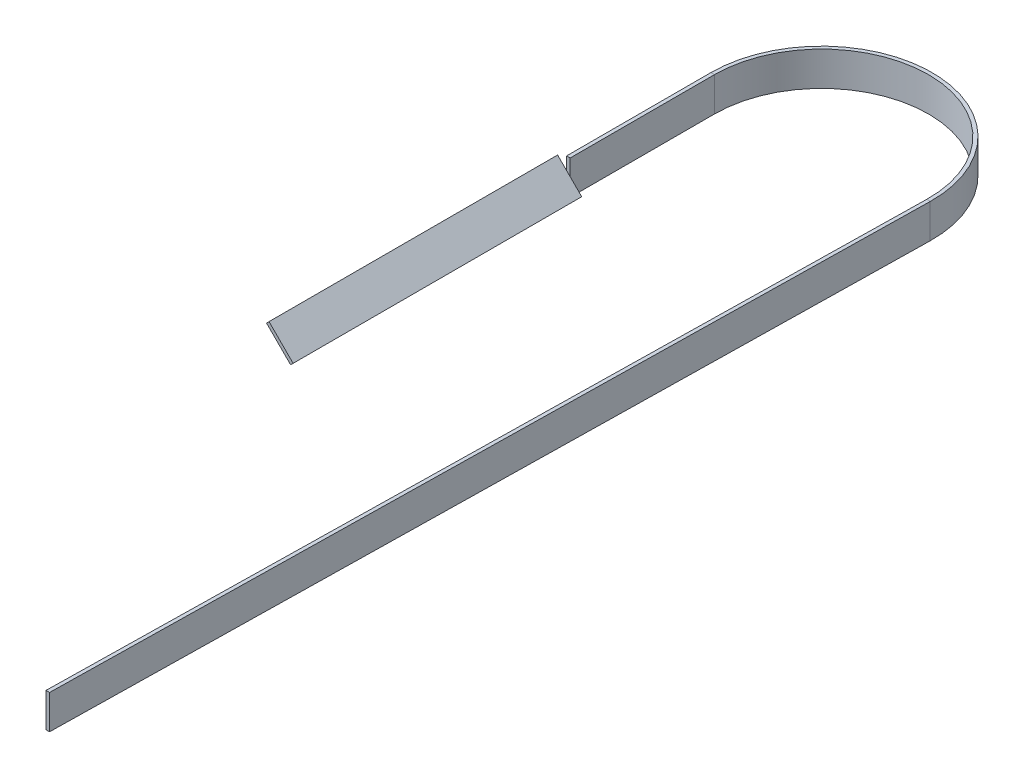
ISO-10303-21;
HEADER;
FILE_DESCRIPTION(('STEP AP214'),'2;1');
FILE_NAME('part.step','',(''),(''),'','','');
FILE_SCHEMA(('AUTOMOTIVE_DESIGN { 1 0 10303 214 1 1 1 1 }'));
ENDSEC;
DATA;
#1=APPLICATION_CONTEXT('core data for automotive mechanical design processes');
#2=APPLICATION_PROTOCOL_DEFINITION('international standard','automotive_design',2000,#1);
#3=PRODUCT_CONTEXT('',#1,'mechanical');
#4=PRODUCT('Part','Part','',(#3));
#5=PRODUCT_RELATED_PRODUCT_CATEGORY('part','',(#4));
#6=PRODUCT_DEFINITION_FORMATION('','',#4);
#7=PRODUCT_DEFINITION_CONTEXT('part definition',#1,'design');
#8=PRODUCT_DEFINITION('design','',#6,#7);
#9=PRODUCT_DEFINITION_SHAPE('','',#8);
#10=(LENGTH_UNIT() NAMED_UNIT(*) SI_UNIT(.MILLI.,.METRE.));
#11=(NAMED_UNIT(*) PLANE_ANGLE_UNIT() SI_UNIT($,.RADIAN.));
#12=(NAMED_UNIT(*) SI_UNIT($,.STERADIAN.) SOLID_ANGLE_UNIT());
#13=UNCERTAINTY_MEASURE_WITH_UNIT(LENGTH_MEASURE(1.E-05),#10,'distance_accuracy_value','');
#14=(GEOMETRIC_REPRESENTATION_CONTEXT(3) GLOBAL_UNCERTAINTY_ASSIGNED_CONTEXT((#13)) GLOBAL_UNIT_ASSIGNED_CONTEXT((#10,
#11,#12)) REPRESENTATION_CONTEXT('',''));
#15=CARTESIAN_POINT('',(0.,0.,0.));
#16=DIRECTION('',(0.,0.,1.));
#17=DIRECTION('',(1.,0.,0.));
#18=AXIS2_PLACEMENT_3D('',#15,#16,#17);
#19=CARTESIAN_POINT('',(0.,0.,25.4));
#20=DIRECTION('',(0.,0.,-1.));
#21=DIRECTION('',(-1.,0.,0.));
#22=AXIS2_PLACEMENT_3D('',#19,#20,#21);
#23=PLANE('',#22);
#24=DIRECTION('',(-0.707106781186544,0.707106781186551,0.));
#25=VECTOR('',#24,1.);
#26=CARTESIAN_POINT('',(-21.0603817089503,-0.655941016831059,25.4));
#27=LINE('',#26,#25);
#28=CARTESIAN_POINT('',(-18.8468,-2.86952272578141,25.4));
#29=VERTEX_POINT('',#28);
#30=CARTESIAN_POINT('',(-19.47680001,-2.2395227157814,25.4));
#31=VERTEX_POINT('',#30);
#32=EDGE_CURVE('E11',#29,#31,#27,.T.);
#33=ORIENTED_EDGE('',*,*,#32,.F.);
#34=DIRECTION('',(0.,-1.,0.));
#35=VECTOR('',#34,1.);
#36=CARTESIAN_POINT('',(-18.8468,0.,25.4));
#37=LINE('',#36,#35);
#38=CARTESIAN_POINT('',(-18.8468,0.,25.4));
#39=VERTEX_POINT('',#38);
#40=EDGE_CURVE('E166',#39,#29,#37,.T.);
#41=ORIENTED_EDGE('',*,*,#40,.F.);
#42=DIRECTION('',(1.,0.,0.));
#43=VECTOR('',#42,1.);
#44=CARTESIAN_POINT('',(-18.8468,0.,25.4));
#45=LINE('',#44,#43);
#46=CARTESIAN_POINT('',(-19.47680001,0.,25.4));
#47=VERTEX_POINT('',#46);
#48=EDGE_CURVE('E183',#47,#39,#45,.T.);
#49=ORIENTED_EDGE('',*,*,#48,.F.);
#50=DIRECTION('',(0.,1.,0.));
#51=VECTOR('',#50,1.);
#52=CARTESIAN_POINT('',(-19.47680001,0.,25.4));
#53=LINE('',#52,#51);
#54=EDGE_CURVE('E51',#31,#47,#53,.T.);
#55=ORIENTED_EDGE('',*,*,#54,.F.);
#56=EDGE_LOOP('',(#33,#41,#49,#55));
#57=FACE_BOUND('',#56,.T.);
#58=ADVANCED_FACE('F33',(#57),#23,.F.);
#59=DIRECTION('',(0.707106781186544,-0.707106781186551,0.));
#60=VECTOR('',#59,1.);
#61=CARTESIAN_POINT('',(-21.5058589881689,-1.10141829604965,25.4));
#62=LINE('',#61,#60);
#63=CARTESIAN_POINT('',(-19.47680001,-3.13047727421859,25.4));
#64=VERTEX_POINT('',#63);
#65=CARTESIAN_POINT('',(-18.8468,-3.7604772842186,25.4));
#66=VERTEX_POINT('',#65);
#67=EDGE_CURVE('E41',#64,#66,#62,.T.);
#68=ORIENTED_EDGE('',*,*,#67,.F.);
#69=CARTESIAN_POINT('',(-19.47680001,-6.,25.4));
#70=VERTEX_POINT('',#69);
#71=EDGE_CURVE('E224',#70,#64,#53,.T.);
#72=ORIENTED_EDGE('',*,*,#71,.F.);
#73=DIRECTION('',(-1.,0.,0.));
#74=VECTOR('',#73,1.);
#75=CARTESIAN_POINT('',(-18.8468,-6.,25.4));
#76=LINE('',#75,#74);
#77=CARTESIAN_POINT('',(-18.8468,-6.,25.4));
#78=VERTEX_POINT('',#77);
#79=EDGE_CURVE('E172',#78,#70,#76,.T.);
#80=ORIENTED_EDGE('',*,*,#79,.F.);
#81=EDGE_CURVE('E162',#66,#78,#37,.T.);
#82=ORIENTED_EDGE('',*,*,#81,.F.);
#83=EDGE_LOOP('',(#68,#72,#80,#82));
#84=FACE_BOUND('',#83,.T.);
#85=ADVANCED_FACE('F307',(#84),#23,.F.);
#86=CARTESIAN_POINT('',(-2.65974674104201,0.,152.376788741834));
#87=DIRECTION('',(-0.0174524064372835,0.,0.999847695156391));
#88=DIRECTION('',(0.999847695156391,0.,0.0174524064372835));
#89=AXIS2_PLACEMENT_3D('',#86,#87,#88);
#90=PLANE('',#89);
#91=DIRECTION('',(0.,-1.,0.));
#92=VECTOR('',#91,1.);
#93=CARTESIAN_POINT('',(16.1841828000315,0.,152.705710755476));
#94=LINE('',#93,#92);
#95=CARTESIAN_POINT('',(16.1841828000315,0.,152.705710755476));
#96=VERTEX_POINT('',#95);
#97=CARTESIAN_POINT('',(16.1841828000315,-6.,152.705710755476));
#98=VERTEX_POINT('',#97);
#99=EDGE_CURVE('E195',#96,#98,#94,.T.);
#100=ORIENTED_EDGE('',*,*,#99,.T.);
#101=DIRECTION('',(0.999847695156391,0.,0.0174524064372835));
#102=VECTOR('',#101,1.);
#103=CARTESIAN_POINT('',(16.1841828000315,-6.,152.705710755476));
#104=LINE('',#103,#102);
#105=CARTESIAN_POINT('',(16.8140868579785,-6.,152.716705771706));
#106=VERTEX_POINT('',#105);
#107=EDGE_CURVE('E201',#98,#106,#104,.T.);
#108=ORIENTED_EDGE('',*,*,#107,.T.);
#109=DIRECTION('',(0.,1.,0.));
#110=VECTOR('',#109,1.);
#111=CARTESIAN_POINT('',(16.8140868579785,0.,152.716705771706));
#112=LINE('',#111,#110);
#113=CARTESIAN_POINT('',(16.8140868579785,0.,152.716705771706));
#114=VERTEX_POINT('',#113);
#115=EDGE_CURVE('E223',#106,#114,#112,.T.);
#116=ORIENTED_EDGE('',*,*,#115,.T.);
#117=DIRECTION('',(-0.999847695156391,0.,-0.0174524064372835));
#118=VECTOR('',#117,1.);
#119=CARTESIAN_POINT('',(16.1841828000315,0.,152.705710755476));
#120=LINE('',#119,#118);
#121=EDGE_CURVE('E36',#114,#96,#120,.T.);
#122=ORIENTED_EDGE('',*,*,#121,.T.);
#123=EDGE_LOOP('',(#100,#108,#116,#122));
#124=FACE_BOUND('',#123,.T.);
#125=ADVANCED_FACE('F287',(#124),#90,.T.);
#126=CARTESIAN_POINT('',(-18.8468,0.,25.4));
#127=DIRECTION('',(1.,0.,0.));
#128=DIRECTION('',(0.,0.,-1.));
#129=AXIS2_PLACEMENT_3D('',#126,#127,#128);
#130=PLANE('',#129);
#131=DIRECTION('',(0.,0.,-1.));
#132=VECTOR('',#131,1.);
#133=CARTESIAN_POINT('',(-18.8468,-6.,25.4));
#134=LINE('',#133,#132);
#135=CARTESIAN_POINT('',(-18.8468,-6.,0.));
#136=VERTEX_POINT('',#135);
#137=EDGE_CURVE('E176',#78,#136,#134,.T.);
#138=ORIENTED_EDGE('',*,*,#137,.T.);
#139=DIRECTION('',(0.,-1.,0.));
#140=VECTOR('',#139,1.);
#141=CARTESIAN_POINT('',(-18.8468,0.,0.));
#142=LINE('',#141,#140);
#143=CARTESIAN_POINT('',(-18.8468,0.,0.));
#144=VERTEX_POINT('',#143);
#145=EDGE_CURVE('E173',#144,#136,#142,.T.);
#146=ORIENTED_EDGE('',*,*,#145,.F.);
#147=DIRECTION('',(0.,0.,-1.));
#148=VECTOR('',#147,1.);
#149=CARTESIAN_POINT('',(-18.8468,0.,25.4));
#150=LINE('',#149,#148);
#151=EDGE_CURVE('E177',#39,#144,#150,.T.);
#152=ORIENTED_EDGE('',*,*,#151,.F.);
#153=ORIENTED_EDGE('',*,*,#40,.T.);
#154=EDGE_CURVE('E164',#29,#66,#37,.T.);
#155=ORIENTED_EDGE('',*,*,#154,.T.);
#156=ORIENTED_EDGE('',*,*,#81,.T.);
#157=EDGE_LOOP('',(#138,#146,#152,#153,#155,#156));
#158=FACE_BOUND('',#157,.T.);
#159=ADVANCED_FACE('F261',(#158),#130,.T.);
#160=CARTESIAN_POINT('',(-18.8468,-6.,25.4));
#161=DIRECTION('',(0.,-1.,0.));
#162=DIRECTION('',(0.,0.,-1.));
#163=AXIS2_PLACEMENT_3D('',#160,#161,#162);
#164=PLANE('',#163);
#165=DIRECTION('',(0.,0.,-1.));
#166=VECTOR('',#165,1.);
#167=CARTESIAN_POINT('',(-19.47680001,-6.,25.4));
#168=LINE('',#167,#166);
#169=CARTESIAN_POINT('',(-19.47680001,-6.,0.));
#170=VERTEX_POINT('',#169);
#171=EDGE_CURVE('E209',#70,#170,#168,.T.);
#172=ORIENTED_EDGE('',*,*,#171,.T.);
#173=DIRECTION('',(-1.,0.,0.));
#174=VECTOR('',#173,1.);
#175=CARTESIAN_POINT('',(-18.8468,-6.,0.));
#176=LINE('',#175,#174);
#177=EDGE_CURVE('E180',#136,#170,#176,.T.);
#178=ORIENTED_EDGE('',*,*,#177,.F.);
#179=ORIENTED_EDGE('',*,*,#137,.F.);
#180=ORIENTED_EDGE('',*,*,#79,.T.);
#181=EDGE_LOOP('',(#172,#178,#179,#180));
#182=FACE_BOUND('',#181,.T.);
#183=ADVANCED_FACE('F305',(#182),#164,.T.);
#184=CARTESIAN_POINT('',(-19.47680001,0.,25.4));
#185=DIRECTION('',(-1.,0.,0.));
#186=DIRECTION('',(0.,0.,1.));
#187=AXIS2_PLACEMENT_3D('',#184,#185,#186);
#188=PLANE('',#187);
#189=DIRECTION('',(0.,0.,-1.));
#190=VECTOR('',#189,1.);
#191=CARTESIAN_POINT('',(-19.47680001,0.,25.4));
#192=LINE('',#191,#190);
#193=CARTESIAN_POINT('',(-19.47680001,0.,0.));
#194=VERTEX_POINT('',#193);
#195=EDGE_CURVE('E229',#47,#194,#192,.T.);
#196=ORIENTED_EDGE('',*,*,#195,.T.);
#197=DIRECTION('',(0.,1.,0.));
#198=VECTOR('',#197,1.);
#199=CARTESIAN_POINT('',(-19.47680001,0.,0.));
#200=LINE('',#199,#198);
#201=EDGE_CURVE('E212',#170,#194,#200,.T.);
#202=ORIENTED_EDGE('',*,*,#201,.F.);
#203=ORIENTED_EDGE('',*,*,#171,.F.);
#204=ORIENTED_EDGE('',*,*,#71,.T.);
#205=EDGE_CURVE('E226',#64,#31,#53,.T.);
#206=ORIENTED_EDGE('',*,*,#205,.T.);
#207=ORIENTED_EDGE('',*,*,#54,.T.);
#208=EDGE_LOOP('',(#196,#202,#203,#204,#206,#207));
#209=FACE_BOUND('',#208,.T.);
#210=ADVANCED_FACE('F303',(#209),#188,.T.);
#211=CARTESIAN_POINT('',(-18.8468,0.,25.4));
#212=DIRECTION('',(0.,1.,0.));
#213=DIRECTION('',(0.,0.,1.));
#214=AXIS2_PLACEMENT_3D('',#211,#212,#213);
#215=PLANE('',#214);
#216=DIRECTION('',(1.,0.,0.));
#217=VECTOR('',#216,1.);
#218=CARTESIAN_POINT('',(-18.8468,0.,0.));
#219=LINE('',#218,#217);
#220=EDGE_CURVE('E194',#194,#144,#219,.T.);
#221=ORIENTED_EDGE('',*,*,#220,.F.);
#222=ORIENTED_EDGE('',*,*,#195,.F.);
#223=ORIENTED_EDGE('',*,*,#48,.T.);
#224=ORIENTED_EDGE('',*,*,#151,.T.);
#225=EDGE_LOOP('',(#221,#222,#223,#224));
#226=FACE_BOUND('',#225,.T.);
#227=ADVANCED_FACE('F263',(#226),#215,.T.);
#228=CARTESIAN_POINT('',(0.,0.,0.));
#229=DIRECTION('',(0.,-1.,0.));
#230=DIRECTION('',(0.,0.,-1.));
#231=AXIS2_PLACEMENT_3D('',#228,#229,#230);
#232=CYLINDRICAL_SURFACE('',#231,18.8468);
#233=CARTESIAN_POINT('',(0.,-6.,0.));
#234=DIRECTION('',(0.,-1.,0.));
#235=DIRECTION('',(-1.,0.,0.));
#236=AXIS2_PLACEMENT_3D('',#233,#234,#235);
#237=CIRCLE('',#236,18.8468);
#238=CARTESIAN_POINT('',(18.8439295410735,-6.,0.328922013642189));
#239=VERTEX_POINT('',#238);
#240=EDGE_CURVE('E187',#136,#239,#237,.T.);
#241=ORIENTED_EDGE('',*,*,#240,.T.);
#242=DIRECTION('',(0.,-1.,0.));
#243=VECTOR('',#242,1.);
#244=CARTESIAN_POINT('',(18.8439295410735,0.,0.32892201364219));
#245=LINE('',#244,#243);
#246=CARTESIAN_POINT('',(18.8439295410735,0.,0.328922013642189));
#247=VERTEX_POINT('',#246);
#248=EDGE_CURVE('E184',#247,#239,#245,.T.);
#249=ORIENTED_EDGE('',*,*,#248,.F.);
#250=CARTESIAN_POINT('',(0.,0.,0.));
#251=DIRECTION('',(0.,-1.,0.));
#252=DIRECTION('',(-1.,0.,0.));
#253=AXIS2_PLACEMENT_3D('',#250,#251,#252);
#254=CIRCLE('',#253,18.8468);
#255=EDGE_CURVE('E188',#144,#247,#254,.T.);
#256=ORIENTED_EDGE('',*,*,#255,.F.);
#257=ORIENTED_EDGE('',*,*,#145,.T.);
#258=EDGE_LOOP('',(#241,#249,#256,#257));
#259=FACE_BOUND('',#258,.T.);
#260=ADVANCED_FACE('F252',(#259),#232,.F.);
#261=CARTESIAN_POINT('',(-18.8468,-6.,0.));
#262=DIRECTION('',(0.,-1.,0.));
#263=DIRECTION('',(0.,0.,-1.));
#264=AXIS2_PLACEMENT_3D('',#261,#262,#263);
#265=PLANE('',#264);
#266=CARTESIAN_POINT('',(0.,-6.,0.));
#267=DIRECTION('',(0.,-1.,0.));
#268=DIRECTION('',(-1.,0.,0.));
#269=AXIS2_PLACEMENT_3D('',#266,#267,#268);
#270=CIRCLE('',#269,19.47680001);
#271=CARTESIAN_POINT('',(19.4738335990205,-6.,0.339917029872201));
#272=VERTEX_POINT('',#271);
#273=EDGE_CURVE('E215',#170,#272,#270,.T.);
#274=ORIENTED_EDGE('',*,*,#273,.T.);
#275=DIRECTION('',(0.999847695156391,0.,0.0174524064372833));
#276=VECTOR('',#275,1.);
#277=CARTESIAN_POINT('',(18.8439295410735,-6.,0.32892201364219));
#278=LINE('',#277,#276);
#279=EDGE_CURVE('E191',#239,#272,#278,.T.);
#280=ORIENTED_EDGE('',*,*,#279,.F.);
#281=ORIENTED_EDGE('',*,*,#240,.F.);
#282=ORIENTED_EDGE('',*,*,#177,.T.);
#283=EDGE_LOOP('',(#274,#280,#281,#282));
#284=FACE_BOUND('',#283,.T.);
#285=ADVANCED_FACE('F295',(#284),#265,.T.);
#286=CARTESIAN_POINT('',(0.,0.,0.));
#287=DIRECTION('',(0.,-1.,0.));
#288=DIRECTION('',(0.,0.,-1.));
#289=AXIS2_PLACEMENT_3D('',#286,#287,#288);
#290=CYLINDRICAL_SURFACE('',#289,19.47680001);
#291=CARTESIAN_POINT('',(0.,0.,0.));
#292=DIRECTION('',(0.,-1.,0.));
#293=DIRECTION('',(-1.,0.,0.));
#294=AXIS2_PLACEMENT_3D('',#291,#292,#293);
#295=CIRCLE('',#294,19.47680001);
#296=CARTESIAN_POINT('',(19.4738335990205,0.,0.339917029872201));
#297=VERTEX_POINT('',#296);
#298=EDGE_CURVE('E234',#194,#297,#295,.T.);
#299=ORIENTED_EDGE('',*,*,#298,.T.);
#300=DIRECTION('',(0.,1.,0.));
#301=VECTOR('',#300,1.);
#302=CARTESIAN_POINT('',(19.4738335990205,0.,0.339917029872204));
#303=LINE('',#302,#301);
#304=EDGE_CURVE('E218',#272,#297,#303,.T.);
#305=ORIENTED_EDGE('',*,*,#304,.F.);
#306=ORIENTED_EDGE('',*,*,#273,.F.);
#307=ORIENTED_EDGE('',*,*,#201,.T.);
#308=EDGE_LOOP('',(#299,#305,#306,#307));
#309=FACE_BOUND('',#308,.T.);
#310=ADVANCED_FACE('F300',(#309),#290,.T.);
#311=CARTESIAN_POINT('',(-18.8468,0.,0.));
#312=DIRECTION('',(0.,1.,0.));
#313=DIRECTION('',(0.,0.,1.));
#314=AXIS2_PLACEMENT_3D('',#311,#312,#313);
#315=PLANE('',#314);
#316=DIRECTION('',(-0.999847695156391,0.,-0.0174524064372833));
#317=VECTOR('',#316,1.);
#318=CARTESIAN_POINT('',(18.8439295410735,0.,0.32892201364219));
#319=LINE('',#318,#317);
#320=EDGE_CURVE('E204',#297,#247,#319,.T.);
#321=ORIENTED_EDGE('',*,*,#320,.F.);
#322=ORIENTED_EDGE('',*,*,#298,.F.);
#323=ORIENTED_EDGE('',*,*,#220,.T.);
#324=ORIENTED_EDGE('',*,*,#255,.T.);
#325=EDGE_LOOP('',(#321,#322,#323,#324));
#326=FACE_BOUND('',#325,.T.);
#327=ADVANCED_FACE('F254',(#326),#315,.T.);
#328=CARTESIAN_POINT('',(18.8439295410735,0.,0.328922013642208));
#329=DIRECTION('',(-0.999847695156391,0.,-0.0174524064372835));
#330=DIRECTION('',(-0.0174524064372835,0.,0.999847695156391));
#331=AXIS2_PLACEMENT_3D('',#328,#329,#330);
#332=PLANE('',#331);
#333=DIRECTION('',(-0.0174524064372835,0.,0.999847695156391));
#334=VECTOR('',#333,1.);
#335=CARTESIAN_POINT('',(18.8439295410735,-6.,0.328922013642208));
#336=LINE('',#335,#334);
#337=EDGE_CURVE('E197',#239,#98,#336,.T.);
#338=ORIENTED_EDGE('',*,*,#337,.T.);
#339=ORIENTED_EDGE('',*,*,#99,.F.);
#340=DIRECTION('',(-0.0174524064372835,0.,0.999847695156391));
#341=VECTOR('',#340,1.);
#342=CARTESIAN_POINT('',(18.8439295410735,0.,0.328922013642208));
#343=LINE('',#342,#341);
#344=EDGE_CURVE('E198',#247,#96,#343,.T.);
#345=ORIENTED_EDGE('',*,*,#344,.F.);
#346=ORIENTED_EDGE('',*,*,#248,.T.);
#347=EDGE_LOOP('',(#338,#339,#345,#346));
#348=FACE_BOUND('',#347,.T.);
#349=ADVANCED_FACE('F290',(#348),#332,.T.);
#350=CARTESIAN_POINT('',(18.8439295410735,-6.,0.328922013642208));
#351=DIRECTION('',(0.,-1.,0.));
#352=DIRECTION('',(0.,0.,-1.));
#353=AXIS2_PLACEMENT_3D('',#350,#351,#352);
#354=PLANE('',#353);
#355=DIRECTION('',(-0.0174524064372835,0.,0.999847695156391));
#356=VECTOR('',#355,1.);
#357=CARTESIAN_POINT('',(19.4738335990205,-6.,0.339917029872221));
#358=LINE('',#357,#356);
#359=EDGE_CURVE('E220',#272,#106,#358,.T.);
#360=ORIENTED_EDGE('',*,*,#359,.T.);
#361=ORIENTED_EDGE('',*,*,#107,.F.);
#362=ORIENTED_EDGE('',*,*,#337,.F.);
#363=ORIENTED_EDGE('',*,*,#279,.T.);
#364=EDGE_LOOP('',(#360,#361,#362,#363));
#365=FACE_BOUND('',#364,.T.);
#366=ADVANCED_FACE('F293',(#365),#354,.T.);
#367=CARTESIAN_POINT('',(19.4738335990205,0.,0.339917029872221));
#368=DIRECTION('',(0.999847695156391,0.,0.0174524064372835));
#369=DIRECTION('',(0.0174524064372835,0.,-0.999847695156391));
#370=AXIS2_PLACEMENT_3D('',#367,#368,#369);
#371=PLANE('',#370);
#372=DIRECTION('',(-0.0174524064372835,0.,0.999847695156391));
#373=VECTOR('',#372,1.);
#374=CARTESIAN_POINT('',(19.4738335990205,0.,0.339917029872221));
#375=LINE('',#374,#373);
#376=EDGE_CURVE('E238',#297,#114,#375,.T.);
#377=ORIENTED_EDGE('',*,*,#376,.T.);
#378=ORIENTED_EDGE('',*,*,#115,.F.);
#379=ORIENTED_EDGE('',*,*,#359,.F.);
#380=ORIENTED_EDGE('',*,*,#304,.T.);
#381=EDGE_LOOP('',(#377,#378,#379,#380));
#382=FACE_BOUND('',#381,.T.);
#383=ADVANCED_FACE('F328',(#382),#371,.T.);
#384=CARTESIAN_POINT('',(18.8439295410735,0.,0.328922013642208));
#385=DIRECTION('',(0.,1.,0.));
#386=DIRECTION('',(0.,0.,1.));
#387=AXIS2_PLACEMENT_3D('',#384,#385,#386);
#388=PLANE('',#387);
#389=ORIENTED_EDGE('',*,*,#121,.F.);
#390=ORIENTED_EDGE('',*,*,#376,.F.);
#391=ORIENTED_EDGE('',*,*,#320,.T.);
#392=ORIENTED_EDGE('',*,*,#344,.T.);
#393=EDGE_LOOP('',(#389,#390,#391,#392));
#394=FACE_BOUND('',#393,.T.);
#395=ADVANCED_FACE('F249',(#394),#388,.T.);
#396=CARTESIAN_POINT('',(0.,0.,25.4));
#397=DIRECTION('',(0.,0.,1.));
#398=DIRECTION('',(1.,0.,0.));
#399=AXIS2_PLACEMENT_3D('',#396,#397,#398);
#400=PLANE('',#399);
#401=ORIENTED_EDGE('',*,*,#154,.F.);
#402=CARTESIAN_POINT('',(-16.8177410218311,-4.89858170395036,25.4));
#403=VERTEX_POINT('',#402);
#404=EDGE_CURVE('E43',#403,#29,#27,.T.);
#405=ORIENTED_EDGE('',*,*,#404,.F.);
#406=DIRECTION('',(0.707106781186551,0.707106781186544,0.));
#407=VECTOR('',#406,1.);
#408=CARTESIAN_POINT('',(-16.8177410218311,-4.89858170395036,25.4));
#409=LINE('',#408,#407);
#410=CARTESIAN_POINT('',(-17.2632183010497,-5.34405898316896,25.4));
#411=VERTEX_POINT('',#410);
#412=EDGE_CURVE('E276',#411,#403,#409,.T.);
#413=ORIENTED_EDGE('',*,*,#412,.F.);
#414=EDGE_CURVE('E271',#66,#411,#62,.T.);
#415=ORIENTED_EDGE('',*,*,#414,.F.);
#416=EDGE_LOOP('',(#401,#405,#413,#415));
#417=FACE_BOUND('',#416,.T.);
#418=ADVANCED_FACE('F269',(#417),#400,.F.);
#419=CARTESIAN_POINT('',(-21.0603817089503,-0.655941016831059,76.2));
#420=DIRECTION('',(0.707106781186543,-0.707106781186552,0.));
#421=DIRECTION('',(0.707106781186552,0.707106781186543,0.));
#422=AXIS2_PLACEMENT_3D('',#419,#420,#421);
#423=PLANE('',#422);
#424=DIRECTION('',(-0.707106781186552,-0.707106781186543,0.));
#425=VECTOR('',#424,1.);
#426=CARTESIAN_POINT('',(-21.0603817089503,-0.655941016831059,25.4));
#427=LINE('',#426,#425);
#428=CARTESIAN_POINT('',(-21.0603817089503,-0.655941016831059,25.4));
#429=VERTEX_POINT('',#428);
#430=CARTESIAN_POINT('',(-21.5058589881689,-1.10141829604965,25.4));
#431=VERTEX_POINT('',#430);
#432=EDGE_CURVE('E161',#429,#431,#427,.T.);
#433=ORIENTED_EDGE('',*,*,#432,.T.);
#434=DIRECTION('',(0.,0.,-1.));
#435=VECTOR('',#434,1.);
#436=CARTESIAN_POINT('',(-21.5058589881689,-1.10141829604965,76.2));
#437=LINE('',#436,#435);
#438=CARTESIAN_POINT('',(-21.5058589881689,-1.10141829604965,76.2));
#439=VERTEX_POINT('',#438);
#440=EDGE_CURVE('E142',#439,#431,#437,.T.);
#441=ORIENTED_EDGE('',*,*,#440,.F.);
#442=DIRECTION('',(-0.707106781186552,-0.707106781186543,0.));
#443=VECTOR('',#442,1.);
#444=CARTESIAN_POINT('',(-21.0603817089503,-0.655941016831059,76.2));
#445=LINE('',#444,#443);
#446=CARTESIAN_POINT('',(-21.0603817089503,-0.655941016831059,76.2));
#447=VERTEX_POINT('',#446);
#448=EDGE_CURVE('E149',#447,#439,#445,.T.);
#449=ORIENTED_EDGE('',*,*,#448,.F.);
#450=DIRECTION('',(0.,0.,-1.));
#451=VECTOR('',#450,1.);
#452=CARTESIAN_POINT('',(-21.0603817089503,-0.655941016831059,76.2));
#453=LINE('',#452,#451);
#454=EDGE_CURVE('E280',#447,#429,#453,.T.);
#455=ORIENTED_EDGE('',*,*,#454,.T.);
#456=EDGE_LOOP('',(#433,#441,#449,#455));
#457=FACE_BOUND('',#456,.T.);
#458=ADVANCED_FACE('F159',(#457),#423,.F.);
#459=CARTESIAN_POINT('',(-21.5058589881689,-1.10141829604965,76.2));
#460=DIRECTION('',(0.707106781186551,0.707106781186544,0.));
#461=DIRECTION('',(-0.707106781186544,0.707106781186551,0.));
#462=AXIS2_PLACEMENT_3D('',#459,#460,#461);
#463=PLANE('',#462);
#464=EDGE_CURVE('E284',#431,#64,#62,.T.);
#465=ORIENTED_EDGE('',*,*,#464,.T.);
#466=ORIENTED_EDGE('',*,*,#67,.T.);
#467=ORIENTED_EDGE('',*,*,#414,.T.);
#468=DIRECTION('',(0.,0.,-1.));
#469=VECTOR('',#468,1.);
#470=CARTESIAN_POINT('',(-17.2632183010497,-5.34405898316896,76.2));
#471=LINE('',#470,#469);
#472=CARTESIAN_POINT('',(-17.2632183010497,-5.34405898316896,76.2));
#473=VERTEX_POINT('',#472);
#474=EDGE_CURVE('E145',#473,#411,#471,.T.);
#475=ORIENTED_EDGE('',*,*,#474,.F.);
#476=DIRECTION('',(0.707106781186544,-0.707106781186551,0.));
#477=VECTOR('',#476,1.);
#478=CARTESIAN_POINT('',(-21.5058589881689,-1.10141829604965,76.2));
#479=LINE('',#478,#477);
#480=EDGE_CURVE('E137',#439,#473,#479,.T.);
#481=ORIENTED_EDGE('',*,*,#480,.F.);
#482=ORIENTED_EDGE('',*,*,#440,.T.);
#483=EDGE_LOOP('',(#465,#466,#467,#475,#481,#482));
#484=FACE_BOUND('',#483,.T.);
#485=ADVANCED_FACE('F140',(#484),#463,.F.);
#486=CARTESIAN_POINT('',(-16.8177410218311,-4.89858170395036,76.2));
#487=DIRECTION('',(-0.707106781186544,0.707106781186551,0.));
#488=DIRECTION('',(-0.707106781186551,-0.707106781186544,0.));
#489=AXIS2_PLACEMENT_3D('',#486,#487,#488);
#490=PLANE('',#489);
#491=ORIENTED_EDGE('',*,*,#412,.T.);
#492=DIRECTION('',(0.,0.,-1.));
#493=VECTOR('',#492,1.);
#494=CARTESIAN_POINT('',(-16.8177410218311,-4.89858170395036,76.2));
#495=LINE('',#494,#493);
#496=CARTESIAN_POINT('',(-16.8177410218311,-4.89858170395036,76.2));
#497=VERTEX_POINT('',#496);
#498=EDGE_CURVE('E167',#497,#403,#495,.T.);
#499=ORIENTED_EDGE('',*,*,#498,.F.);
#500=DIRECTION('',(0.707106781186551,0.707106781186544,0.));
#501=VECTOR('',#500,1.);
#502=CARTESIAN_POINT('',(-16.8177410218311,-4.89858170395036,76.2));
#503=LINE('',#502,#501);
#504=EDGE_CURVE('E148',#473,#497,#503,.T.);
#505=ORIENTED_EDGE('',*,*,#504,.F.);
#506=ORIENTED_EDGE('',*,*,#474,.T.);
#507=EDGE_LOOP('',(#491,#499,#505,#506));
#508=FACE_BOUND('',#507,.T.);
#509=ADVANCED_FACE('F360',(#508),#490,.F.);
#510=CARTESIAN_POINT('',(-21.0603817089503,-0.655941016831059,76.2));
#511=DIRECTION('',(-0.707106781186551,-0.707106781186544,0.));
#512=DIRECTION('',(0.707106781186544,-0.707106781186551,0.));
#513=AXIS2_PLACEMENT_3D('',#510,#511,#512);
#514=PLANE('',#513);
#515=ORIENTED_EDGE('',*,*,#404,.T.);
#516=ORIENTED_EDGE('',*,*,#32,.T.);
#517=EDGE_CURVE('E44',#31,#429,#27,.T.);
#518=ORIENTED_EDGE('',*,*,#517,.T.);
#519=ORIENTED_EDGE('',*,*,#454,.F.);
#520=DIRECTION('',(-0.707106781186544,0.707106781186551,0.));
#521=VECTOR('',#520,1.);
#522=CARTESIAN_POINT('',(-21.0603817089503,-0.655941016831059,76.2));
#523=LINE('',#522,#521);
#524=EDGE_CURVE('E154',#497,#447,#523,.T.);
#525=ORIENTED_EDGE('',*,*,#524,.F.);
#526=ORIENTED_EDGE('',*,*,#498,.T.);
#527=EDGE_LOOP('',(#515,#516,#518,#519,#525,#526));
#528=FACE_BOUND('',#527,.T.);
#529=ADVANCED_FACE('F274',(#528),#514,.F.);
#530=CARTESIAN_POINT('',(0.,0.,76.2));
#531=DIRECTION('',(0.,0.,1.));
#532=DIRECTION('',(1.,0.,0.));
#533=AXIS2_PLACEMENT_3D('',#530,#531,#532);
#534=PLANE('',#533);
#535=ORIENTED_EDGE('',*,*,#448,.T.);
#536=ORIENTED_EDGE('',*,*,#480,.T.);
#537=ORIENTED_EDGE('',*,*,#504,.T.);
#538=ORIENTED_EDGE('',*,*,#524,.T.);
#539=EDGE_LOOP('',(#535,#536,#537,#538));
#540=FACE_BOUND('',#539,.T.);
#541=ADVANCED_FACE('F152',(#540),#534,.T.);
#542=ORIENTED_EDGE('',*,*,#205,.F.);
#543=ORIENTED_EDGE('',*,*,#464,.F.);
#544=ORIENTED_EDGE('',*,*,#432,.F.);
#545=ORIENTED_EDGE('',*,*,#517,.F.);
#546=EDGE_LOOP('',(#542,#543,#544,#545));
#547=FACE_BOUND('',#546,.T.);
#548=ADVANCED_FACE('F311',(#547),#400,.F.);
#549=CLOSED_SHELL('',(#58,#85,#125,#159,#183,#210,#227,#260,#285,#310,#327,#349,#366,#383,#395,
#418,#458,#485,#509,#529,#541,#548));
#550=MANIFOLD_SOLID_BREP('B2',#549);
#551=ADVANCED_BREP_SHAPE_REPRESENTATION('',(#18,#550),#14);
#552=SHAPE_DEFINITION_REPRESENTATION(#9,#551);
ENDSEC;
END-ISO-10303-21;
